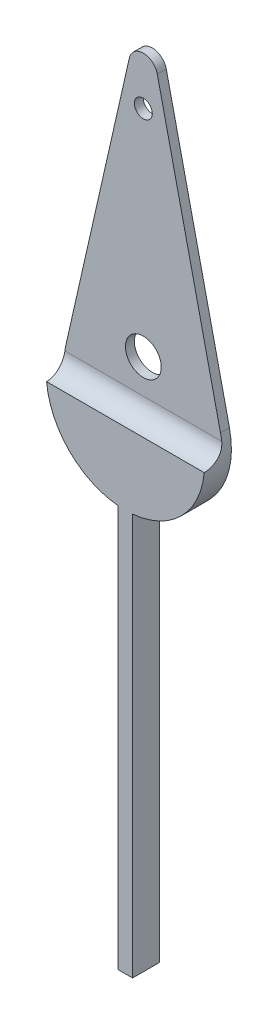
ISO-10303-21;
HEADER;
FILE_DESCRIPTION(('STEP AP214'),'2;1');
FILE_NAME('part.step','',(''),(''),'','','');
FILE_SCHEMA(('AUTOMOTIVE_DESIGN { 1 0 10303 214 1 1 1 1 }'));
ENDSEC;
DATA;
#1=APPLICATION_CONTEXT('core data for automotive mechanical design processes');
#2=APPLICATION_PROTOCOL_DEFINITION('international standard','automotive_design',2000,#1);
#3=PRODUCT_CONTEXT('',#1,'mechanical');
#4=PRODUCT('Part','Part','',(#3));
#5=PRODUCT_RELATED_PRODUCT_CATEGORY('part','',(#4));
#6=PRODUCT_DEFINITION_FORMATION('','',#4);
#7=PRODUCT_DEFINITION_CONTEXT('part definition',#1,'design');
#8=PRODUCT_DEFINITION('design','',#6,#7);
#9=PRODUCT_DEFINITION_SHAPE('','',#8);
#10=(LENGTH_UNIT() NAMED_UNIT(*) SI_UNIT(.MILLI.,.METRE.));
#11=(NAMED_UNIT(*) PLANE_ANGLE_UNIT() SI_UNIT($,.RADIAN.));
#12=(NAMED_UNIT(*) SI_UNIT($,.STERADIAN.) SOLID_ANGLE_UNIT());
#13=UNCERTAINTY_MEASURE_WITH_UNIT(LENGTH_MEASURE(1.E-05),#10,'distance_accuracy_value','');
#14=(GEOMETRIC_REPRESENTATION_CONTEXT(3) GLOBAL_UNCERTAINTY_ASSIGNED_CONTEXT((#13)) GLOBAL_UNIT_ASSIGNED_CONTEXT((#10,
#11,#12)) REPRESENTATION_CONTEXT('',''));
#15=CARTESIAN_POINT('',(0.,0.,0.));
#16=DIRECTION('',(0.,0.,1.));
#17=DIRECTION('',(1.,0.,0.));
#18=AXIS2_PLACEMENT_3D('',#15,#16,#17);
#19=CARTESIAN_POINT('',(6.,-47.5,1.5));
#20=DIRECTION('',(0.,0.,1.));
#21=DIRECTION('',(1.,0.,0.));
#22=AXIS2_PLACEMENT_3D('',#19,#20,#21);
#23=PLANE('',#22);
#24=CARTESIAN_POINT('',(6.,-47.5,1.5));
#25=DIRECTION('',(0.,0.,1.));
#26=DIRECTION('',(1.,0.,0.));
#27=AXIS2_PLACEMENT_3D('',#24,#25,#26);
#28=CIRCLE('',#27,4.41549896987108);
#29=CARTESIAN_POINT('',(6.4,-51.8973436473549,1.5));
#30=VERTEX_POINT('',#29);
#31=CARTESIAN_POINT('',(10.3975844709157,-47.8973436473549,1.5));
#32=VERTEX_POINT('',#31);
#33=EDGE_CURVE('E260',#30,#32,#28,.T.);
#34=ORIENTED_EDGE('',*,*,#33,.T.);
#35=DIRECTION('',(-1.,0.,0.));
#36=VECTOR('',#35,1.);
#37=CARTESIAN_POINT('',(1.58450103012892,-47.8973436473549,1.5));
#38=LINE('',#37,#36);
#39=CARTESIAN_POINT('',(1.60241552908426,-47.8973436473549,1.5));
#40=VERTEX_POINT('',#39);
#41=EDGE_CURVE('E154',#32,#40,#38,.T.);
#42=ORIENTED_EDGE('',*,*,#41,.T.);
#43=CARTESIAN_POINT('',(6.,-47.5,1.5));
#44=DIRECTION('',(0.,0.,1.));
#45=DIRECTION('',(1.,0.,0.));
#46=AXIS2_PLACEMENT_3D('',#43,#44,#45);
#47=CIRCLE('',#46,4.41549896987108);
#48=CARTESIAN_POINT('',(5.6,-51.8973436473549,1.5));
#49=VERTEX_POINT('',#48);
#50=EDGE_CURVE('E159',#40,#49,#47,.T.);
#51=ORIENTED_EDGE('',*,*,#50,.T.);
#52=DIRECTION('',(0.,-1.,0.));
#53=VECTOR('',#52,1.);
#54=CARTESIAN_POINT('',(5.6,-51.8973436473549,1.5));
#55=LINE('',#54,#53);
#56=CARTESIAN_POINT('',(5.6,-74.3160955271791,1.5));
#57=VERTEX_POINT('',#56);
#58=EDGE_CURVE('E287',#49,#57,#55,.T.);
#59=ORIENTED_EDGE('',*,*,#58,.T.);
#60=DIRECTION('',(1.,0.,0.));
#61=VECTOR('',#60,1.);
#62=CARTESIAN_POINT('',(5.6,-74.3160955271791,1.5));
#63=LINE('',#62,#61);
#64=CARTESIAN_POINT('',(6.4,-74.3160955271791,1.5));
#65=VERTEX_POINT('',#64);
#66=EDGE_CURVE('E309',#57,#65,#63,.T.);
#67=ORIENTED_EDGE('',*,*,#66,.T.);
#68=DIRECTION('',(0.,1.,0.));
#69=VECTOR('',#68,1.);
#70=CARTESIAN_POINT('',(6.4,-51.8973436473549,1.5));
#71=LINE('',#70,#69);
#72=EDGE_CURVE('E269',#65,#30,#71,.T.);
#73=ORIENTED_EDGE('',*,*,#72,.T.);
#74=EDGE_LOOP('',(#34,#42,#51,#59,#67,#73));
#75=FACE_BOUND('',#74,.T.);
#76=ADVANCED_FACE('F40',(#75),#23,.T.);
#77=CARTESIAN_POINT('',(6.,-27.5,1.5));
#78=DIRECTION('',(-0.975324777762602,-0.220774948493554,0.));
#79=DIRECTION('',(0.220774948493554,-0.975324777762602,0.));
#80=AXIS2_PLACEMENT_3D('',#77,#78,#79);
#81=PLANE('',#80);
#82=DIRECTION('',(-0.220774948493554,0.975324777762602,0.));
#83=VECTOR('',#82,1.);
#84=CARTESIAN_POINT('',(6.,-27.5,0.));
#85=LINE('',#84,#83);
#86=CARTESIAN_POINT('',(10.3065455515005,-46.5251684423534,0.));
#87=VERTEX_POINT('',#86);
#88=CARTESIAN_POINT('',(6.78025982221008,-30.9469795730305,0.));
#89=VERTEX_POINT('',#88);
#90=EDGE_CURVE('E314',#87,#89,#85,.T.);
#91=ORIENTED_EDGE('',*,*,#90,.T.);
#92=DIRECTION('',(0.,0.,-1.));
#93=VECTOR('',#92,1.);
#94=CARTESIAN_POINT('',(6.78025982221008,-30.9469795730305,1.5));
#95=LINE('',#94,#93);
#96=CARTESIAN_POINT('',(6.78025982221008,-30.9469795730305,0.499999999999996));
#97=VERTEX_POINT('',#96);
#98=EDGE_CURVE('E49',#89,#97,#95,.F.);
#99=ORIENTED_EDGE('',*,*,#98,.T.);
#100=DIRECTION('',(-0.220774948493554,0.975324777762602,0.));
#101=VECTOR('',#100,1.);
#102=CARTESIAN_POINT('',(6.,-27.5,0.499999999999997));
#103=LINE('',#102,#101);
#104=CARTESIAN_POINT('',(10.3065455515005,-46.5251684423534,0.499999999999994));
#105=VERTEX_POINT('',#104);
#106=EDGE_CURVE('E249',#105,#97,#103,.T.);
#107=ORIENTED_EDGE('',*,*,#106,.F.);
#108=DIRECTION('',(0.,0.,-1.));
#109=VECTOR('',#108,1.);
#110=CARTESIAN_POINT('',(10.3065455515005,-46.5251684423534,1.5));
#111=LINE('',#110,#109);
#112=EDGE_CURVE('E258',#105,#87,#111,.T.);
#113=ORIENTED_EDGE('',*,*,#112,.T.);
#114=EDGE_LOOP('',(#91,#99,#107,#113));
#115=FACE_BOUND('',#114,.T.);
#116=ADVANCED_FACE('F223',(#115),#81,.F.);
#117=CARTESIAN_POINT('',(6.,-27.5,1.5));
#118=DIRECTION('',(0.975324777762602,-0.220774948493554,0.));
#119=DIRECTION('',(0.220774948493554,0.975324777762602,0.));
#120=AXIS2_PLACEMENT_3D('',#117,#118,#119);
#121=PLANE('',#120);
#122=DIRECTION('',(-0.220774948493554,-0.975324777762602,0.));
#123=VECTOR('',#122,1.);
#124=CARTESIAN_POINT('',(6.,-27.5,0.499999999999997));
#125=LINE('',#124,#123);
#126=CARTESIAN_POINT('',(5.21974017778992,-30.9469795730305,0.499999999999996));
#127=VERTEX_POINT('',#126);
#128=CARTESIAN_POINT('',(1.69345444849949,-46.5251684423534,0.499999999999994));
#129=VERTEX_POINT('',#128);
#130=EDGE_CURVE('E139',#127,#129,#125,.T.);
#131=ORIENTED_EDGE('',*,*,#130,.F.);
#132=DIRECTION('',(0.,0.,-1.));
#133=VECTOR('',#132,1.);
#134=CARTESIAN_POINT('',(5.21974017778992,-30.9469795730305,1.5));
#135=LINE('',#134,#133);
#136=CARTESIAN_POINT('',(5.21974017778992,-30.9469795730305,0.));
#137=VERTEX_POINT('',#136);
#138=EDGE_CURVE('E196',#127,#137,#135,.T.);
#139=ORIENTED_EDGE('',*,*,#138,.T.);
#140=DIRECTION('',(-0.220774948493554,-0.975324777762602,0.));
#141=VECTOR('',#140,1.);
#142=CARTESIAN_POINT('',(6.,-27.5,0.));
#143=LINE('',#142,#141);
#144=CARTESIAN_POINT('',(1.69345444849949,-46.5251684423534,0.));
#145=VERTEX_POINT('',#144);
#146=EDGE_CURVE('E301',#137,#145,#143,.T.);
#147=ORIENTED_EDGE('',*,*,#146,.T.);
#148=DIRECTION('',(0.,0.,-1.));
#149=VECTOR('',#148,1.);
#150=CARTESIAN_POINT('',(1.69345444849949,-46.5251684423534,1.5));
#151=LINE('',#150,#149);
#152=EDGE_CURVE('E197',#129,#145,#151,.T.);
#153=ORIENTED_EDGE('',*,*,#152,.F.);
#154=EDGE_LOOP('',(#131,#139,#147,#153));
#155=FACE_BOUND('',#154,.T.);
#156=ADVANCED_FACE('F228',(#155),#121,.F.);
#157=CARTESIAN_POINT('',(6.,-47.5,1.5));
#158=DIRECTION('',(0.,0.,-1.));
#159=DIRECTION('',(-1.,0.,0.));
#160=AXIS2_PLACEMENT_3D('',#157,#158,#159);
#161=CYLINDRICAL_SURFACE('',#160,4.41549896987108);
#162=CARTESIAN_POINT('',(1.62582162303033,-46.8973436473549,0.499999999999964));
#163=CARTESIAN_POINT('',(1.62204583926666,-46.9247388762689,0.499999935760209));
#164=CARTESIAN_POINT('',(1.61853212360123,-46.952157922839,0.501126563499402));
#165=CARTESIAN_POINT('',(1.61203755839999,-47.0068730528856,0.505637084601678));
#166=CARTESIAN_POINT('',(1.60905671034121,-47.0341691360211,0.509020984221426));
#167=CARTESIAN_POINT('',(1.60093741353267,-47.1155084002359,0.522546376883282));
#168=CARTESIAN_POINT('',(1.59660706916634,-47.1691133518118,0.536061550523393));
#169=CARTESIAN_POINT('',(1.59000368339094,-47.273486793239,0.571794441656592));
#170=CARTESIAN_POINT('',(1.58773214937031,-47.3242531793172,0.594018518477377));
#171=CARTESIAN_POINT('',(1.58493186487038,-47.4214555904829,0.646561646914125));
#172=CARTESIAN_POINT('',(1.58440287126643,-47.4678922187931,0.676879568613588));
#173=CARTESIAN_POINT('',(1.5846292260879,-47.5551407860134,0.744777370298352));
#174=CARTESIAN_POINT('',(1.58538525859495,-47.5959497165228,0.782361108789357));
#175=CARTESIAN_POINT('',(1.58764653127134,-47.6708026632169,0.863746581774264));
#176=CARTESIAN_POINT('',(1.58915196940392,-47.7048448885798,0.907549957063057));
#177=CARTESIAN_POINT('',(1.59239172874912,-47.7656371265169,1.00079412884773));
#178=CARTESIAN_POINT('',(1.59412887025198,-47.7922822834174,1.05030315941065));
#179=CARTESIAN_POINT('',(1.5973159723718,-47.8369081876826,1.15308018326418));
#180=CARTESIAN_POINT('',(1.59876607195426,-47.8548931337839,1.20634634059337));
#181=CARTESIAN_POINT('',(1.6006943263435,-47.8779369958278,1.29984442372338));
#182=CARTESIAN_POINT('',(1.60133100233884,-47.8852063324992,1.33954306319262));
#183=CARTESIAN_POINT('',(1.60219579466493,-47.8949115034814,1.41948897353512));
#184=CARTESIAN_POINT('',(1.60242433451028,-47.8973523485038,1.45973563197671));
#185=CARTESIAN_POINT('',(1.60241552908426,-47.8973436473549,1.5));
#186=B_SPLINE_CURVE_WITH_KNOTS('',3,(#162,#163,#164,#165,#166,#167,#168,#169,#170,#171,#172,
#173,#174,#175,#176,#177,#178,#179,#180,#181,#182,#183,#184,#185),.UNSPECIFIED.,.F.,.F.,(4,2,2,
2,2,2,2,2,2,2,2,4),(0.,0.0829136028333963,0.165827435486195,0.331324009229433,0.496941656081441,
0.662536194466835,0.828218914457806,0.993945424497027,1.16191341182595,1.32979988090902,
1.45061020657461,1.57129509681288),.UNSPECIFIED.);
#187=CARTESIAN_POINT('',(1.62582162303033,-46.8973436473549,0.499999999999994));
#188=VERTEX_POINT('',#187);
#189=EDGE_CURVE('E145',#188,#40,#186,.T.);
#190=ORIENTED_EDGE('',*,*,#189,.F.);
#191=CARTESIAN_POINT('',(6.,-47.5,0.499999999999994));
#192=DIRECTION('',(0.,0.,1.));
#193=DIRECTION('',(0.,-1.,0.));
#194=AXIS2_PLACEMENT_3D('',#191,#192,#193);
#195=CIRCLE('',#194,4.41549896987108);
#196=EDGE_CURVE('E133',#129,#188,#195,.T.);
#197=ORIENTED_EDGE('',*,*,#196,.F.);
#198=ORIENTED_EDGE('',*,*,#152,.T.);
#199=CARTESIAN_POINT('',(6.,-47.5,0.));
#200=DIRECTION('',(0.,0.,1.));
#201=DIRECTION('',(1.,0.,0.));
#202=AXIS2_PLACEMENT_3D('',#199,#200,#201);
#203=CIRCLE('',#202,4.41549896987108);
#204=CARTESIAN_POINT('',(5.6,-51.8973436473549,0.));
#205=VERTEX_POINT('',#204);
#206=EDGE_CURVE('E291',#145,#205,#203,.T.);
#207=ORIENTED_EDGE('',*,*,#206,.T.);
#208=DIRECTION('',(0.,0.,-1.));
#209=VECTOR('',#208,1.);
#210=CARTESIAN_POINT('',(5.6,-51.8973436473549,1.5));
#211=LINE('',#210,#209);
#212=EDGE_CURVE('E257',#49,#205,#211,.T.);
#213=ORIENTED_EDGE('',*,*,#212,.F.);
#214=ORIENTED_EDGE('',*,*,#50,.F.);
#215=EDGE_LOOP('',(#190,#197,#198,#207,#213,#214));
#216=FACE_BOUND('',#215,.T.);
#217=ADVANCED_FACE('F157',(#216),#161,.T.);
#218=CARTESIAN_POINT('',(6.,-47.5,1.5));
#219=DIRECTION('',(0.,0.,-1.));
#220=DIRECTION('',(-1.,0.,0.));
#221=AXIS2_PLACEMENT_3D('',#218,#219,#220);
#222=CYLINDRICAL_SURFACE('',#221,4.41549896987108);
#223=CARTESIAN_POINT('',(10.3975844709157,-47.8973436473549,1.5));
#224=CARTESIAN_POINT('',(10.3975829180978,-47.8973435369531,1.47190037807518));
#225=CARTESIAN_POINT('',(10.3976917261108,-47.8961585248377,1.44381431099081));
#226=CARTESIAN_POINT('',(10.3981156011552,-47.8914315175774,1.38784485000167));
#227=CARTESIAN_POINT('',(10.3984306532947,-47.8878896926055,1.35996144161093));
#228=CARTESIAN_POINT('',(10.3996619954915,-47.8737653429627,1.27697449464489));
#229=CARTESIAN_POINT('',(10.4008645734437,-47.859683833374,1.22242939438074));
#230=CARTESIAN_POINT('',(10.4037382606811,-47.8225870379193,1.11648948703224));
#231=CARTESIAN_POINT('',(10.4054095477684,-47.7995683605139,1.06509588448416));
#232=CARTESIAN_POINT('',(10.4087666512496,-47.7452458690494,0.966887735414993));
#233=CARTESIAN_POINT('',(10.4104524667453,-47.7139425636675,0.920072907998244));
#234=CARTESIAN_POINT('',(10.4132947288033,-47.6438423310132,0.832238864481918));
#235=CARTESIAN_POINT('',(10.4144499336699,-47.605028125664,0.791233396390601));
#236=CARTESIAN_POINT('',(10.4156480350228,-47.5210451668558,0.716315155575321));
#237=CARTESIAN_POINT('',(10.4156908791132,-47.4758761141623,0.682402717032316));
#238=CARTESIAN_POINT('',(10.4141443140146,-47.3808227873252,0.622860880459064));
#239=CARTESIAN_POINT('',(10.4125658191741,-47.3309720681659,0.597177603510841));
#240=CARTESIAN_POINT('',(10.4074014714243,-47.2277778617109,0.554523639876488));
#241=CARTESIAN_POINT('',(10.4038166505172,-47.1744361825209,0.537548482555747));
#242=CARTESIAN_POINT('',(10.3959691130568,-47.0835361373131,0.516766410843859));
#243=CARTESIAN_POINT('',(10.3923039505298,-47.0464735698626,0.510473822389614));
#244=CARTESIAN_POINT('',(10.3839824378447,-46.9720368459461,0.502089837553739));
#245=CARTESIAN_POINT('',(10.3793274204467,-46.9346631727331,0.499992831285645));
#246=CARTESIAN_POINT('',(10.3741783769697,-46.8973436473549,0.499999999999964));
#247=B_SPLINE_CURVE_WITH_KNOTS('',3,(#223,#224,#225,#226,#227,#228,#229,#230,#231,#232,#233,
#234,#235,#236,#237,#238,#239,#240,#241,#242,#243,#244,#245,#246),.UNSPECIFIED.,.F.,.F.,(4,2,2,
2,2,2,2,2,2,2,2,4),(0.,0.084246809003493,0.168487535652777,0.336658490566312,0.504893326655594,
0.673117835503424,0.841734029983362,1.01035816685727,1.17785457082816,1.34526489806432,
1.45834531696421,1.57127443543271),.UNSPECIFIED.);
#248=CARTESIAN_POINT('',(10.3741783769697,-46.8973436473549,0.499999999999964));
#249=VERTEX_POINT('',#248);
#250=EDGE_CURVE('E151',#32,#249,#247,.T.);
#251=ORIENTED_EDGE('',*,*,#250,.F.);
#252=ORIENTED_EDGE('',*,*,#33,.F.);
#253=DIRECTION('',(0.,0.,-1.));
#254=VECTOR('',#253,1.);
#255=CARTESIAN_POINT('',(6.4,-51.8973436473549,1.5));
#256=LINE('',#255,#254);
#257=CARTESIAN_POINT('',(6.4,-51.8973436473549,0.));
#258=VERTEX_POINT('',#257);
#259=EDGE_CURVE('E259',#30,#258,#256,.T.);
#260=ORIENTED_EDGE('',*,*,#259,.T.);
#261=CARTESIAN_POINT('',(6.,-47.5,0.));
#262=DIRECTION('',(0.,0.,1.));
#263=DIRECTION('',(1.,0.,0.));
#264=AXIS2_PLACEMENT_3D('',#261,#262,#263);
#265=CIRCLE('',#264,4.41549896987108);
#266=EDGE_CURVE('E272',#258,#87,#265,.T.);
#267=ORIENTED_EDGE('',*,*,#266,.T.);
#268=ORIENTED_EDGE('',*,*,#112,.F.);
#269=CARTESIAN_POINT('',(6.,-47.5,0.499999999999994));
#270=DIRECTION('',(0.,0.,1.));
#271=DIRECTION('',(0.,-1.,0.));
#272=AXIS2_PLACEMENT_3D('',#269,#270,#271);
#273=CIRCLE('',#272,4.41549896987108);
#274=EDGE_CURVE('E244',#249,#105,#273,.T.);
#275=ORIENTED_EDGE('',*,*,#274,.F.);
#276=EDGE_LOOP('',(#251,#252,#260,#267,#268,#275));
#277=FACE_BOUND('',#276,.T.);
#278=ADVANCED_FACE('F201',(#277),#222,.T.);
#279=CARTESIAN_POINT('',(6.,-33.,1.5));
#280=DIRECTION('',(0.,0.,-1.));
#281=DIRECTION('',(-1.,0.,0.));
#282=AXIS2_PLACEMENT_3D('',#279,#280,#281);
#283=CYLINDRICAL_SURFACE('',#282,0.500000000000001);
#284=CARTESIAN_POINT('',(6.,-33.,0.));
#285=DIRECTION('',(0.,0.,1.));
#286=DIRECTION('',(1.,0.,0.));
#287=AXIS2_PLACEMENT_3D('',#284,#285,#286);
#288=CIRCLE('',#287,0.500000000000001);
#289=CARTESIAN_POINT('',(6.5,-33.,0.));
#290=VERTEX_POINT('',#289);
#291=EDGE_CURVE('E166',#290,#290,#288,.T.);
#292=ORIENTED_EDGE('',*,*,#291,.F.);
#293=EDGE_LOOP('',(#292));
#294=FACE_BOUND('',#293,.T.);
#295=CARTESIAN_POINT('',(6.,-33.,0.499999999999996));
#296=DIRECTION('',(0.,0.,1.));
#297=DIRECTION('',(0.,-1.,0.));
#298=AXIS2_PLACEMENT_3D('',#295,#296,#297);
#299=CIRCLE('',#298,0.500000000000001);
#300=CARTESIAN_POINT('',(6.,-33.5,0.499999999999996));
#301=VERTEX_POINT('',#300);
#302=EDGE_CURVE('E241',#301,#301,#299,.T.);
#303=ORIENTED_EDGE('',*,*,#302,.T.);
#304=EDGE_LOOP('',(#303));
#305=FACE_BOUND('',#304,.T.);
#306=ADVANCED_FACE('F206',(#294,#305),#283,.F.);
#307=CARTESIAN_POINT('',(6.,-45.,1.5));
#308=DIRECTION('',(0.,0.,-1.));
#309=DIRECTION('',(-1.,0.,0.));
#310=AXIS2_PLACEMENT_3D('',#307,#308,#309);
#311=CYLINDRICAL_SURFACE('',#310,1.);
#312=CARTESIAN_POINT('',(6.,-45.,0.));
#313=DIRECTION('',(0.,0.,1.));
#314=DIRECTION('',(1.,0.,0.));
#315=AXIS2_PLACEMENT_3D('',#312,#313,#314);
#316=CIRCLE('',#315,1.);
#317=CARTESIAN_POINT('',(7.,-45.,0.));
#318=VERTEX_POINT('',#317);
#319=EDGE_CURVE('E161',#318,#318,#316,.T.);
#320=ORIENTED_EDGE('',*,*,#319,.F.);
#321=EDGE_LOOP('',(#320));
#322=FACE_BOUND('',#321,.T.);
#323=CARTESIAN_POINT('',(6.,-45.,0.499999999999994));
#324=DIRECTION('',(0.,0.,1.));
#325=DIRECTION('',(0.,-1.,0.));
#326=AXIS2_PLACEMENT_3D('',#323,#324,#325);
#327=CIRCLE('',#326,1.);
#328=CARTESIAN_POINT('',(6.,-46.,0.499999999999994));
#329=VERTEX_POINT('',#328);
#330=EDGE_CURVE('E198',#329,#329,#327,.T.);
#331=ORIENTED_EDGE('',*,*,#330,.T.);
#332=EDGE_LOOP('',(#331));
#333=FACE_BOUND('',#332,.T.);
#334=ADVANCED_FACE('F184',(#322,#333),#311,.F.);
#335=CARTESIAN_POINT('',(6.,-47.5,0.));
#336=DIRECTION('',(0.,0.,1.));
#337=DIRECTION('',(1.,0.,0.));
#338=AXIS2_PLACEMENT_3D('',#335,#336,#337);
#339=PLANE('',#338);
#340=ORIENTED_EDGE('',*,*,#146,.F.);
#341=CARTESIAN_POINT('',(6.,-31.1235995318253,0.));
#342=DIRECTION('',(0.,0.,1.));
#343=DIRECTION('',(1.,0.,0.));
#344=AXIS2_PLACEMENT_3D('',#341,#342,#343);
#345=CIRCLE('',#344,0.8);
#346=EDGE_CURVE('E68',#137,#89,#345,.F.);
#347=ORIENTED_EDGE('',*,*,#346,.T.);
#348=ORIENTED_EDGE('',*,*,#90,.F.);
#349=ORIENTED_EDGE('',*,*,#266,.F.);
#350=DIRECTION('',(0.,1.,0.));
#351=VECTOR('',#350,1.);
#352=CARTESIAN_POINT('',(6.4,-51.8973436473549,0.));
#353=LINE('',#352,#351);
#354=CARTESIAN_POINT('',(6.4,-74.3160955271791,0.));
#355=VERTEX_POINT('',#354);
#356=EDGE_CURVE('E298',#355,#258,#353,.T.);
#357=ORIENTED_EDGE('',*,*,#356,.F.);
#358=DIRECTION('',(1.,0.,0.));
#359=VECTOR('',#358,1.);
#360=CARTESIAN_POINT('',(5.6,-74.3160955271791,0.));
#361=LINE('',#360,#359);
#362=CARTESIAN_POINT('',(5.6,-74.3160955271791,0.));
#363=VERTEX_POINT('',#362);
#364=EDGE_CURVE('E293',#363,#355,#361,.T.);
#365=ORIENTED_EDGE('',*,*,#364,.F.);
#366=DIRECTION('',(0.,-1.,0.));
#367=VECTOR('',#366,1.);
#368=CARTESIAN_POINT('',(5.6,-51.8973436473549,0.));
#369=LINE('',#368,#367);
#370=EDGE_CURVE('E286',#205,#363,#369,.T.);
#371=ORIENTED_EDGE('',*,*,#370,.F.);
#372=ORIENTED_EDGE('',*,*,#206,.F.);
#373=EDGE_LOOP('',(#340,#347,#348,#349,#357,#365,#371,#372));
#374=FACE_BOUND('',#373,.T.);
#375=ORIENTED_EDGE('',*,*,#291,.T.);
#376=EDGE_LOOP('',(#375));
#377=FACE_BOUND('',#376,.T.);
#378=ORIENTED_EDGE('',*,*,#319,.T.);
#379=EDGE_LOOP('',(#378));
#380=FACE_BOUND('',#379,.T.);
#381=ADVANCED_FACE('F208',(#374,#377,#380),#339,.F.);
#382=CARTESIAN_POINT('',(5.6,-51.8973436473549,1.5));
#383=DIRECTION('',(1.,0.,0.));
#384=DIRECTION('',(0.,1.,0.));
#385=AXIS2_PLACEMENT_3D('',#382,#383,#384);
#386=PLANE('',#385);
#387=ORIENTED_EDGE('',*,*,#370,.T.);
#388=DIRECTION('',(0.,0.,-1.));
#389=VECTOR('',#388,1.);
#390=CARTESIAN_POINT('',(5.6,-74.3160955271791,1.5));
#391=LINE('',#390,#389);
#392=EDGE_CURVE('E277',#57,#363,#391,.T.);
#393=ORIENTED_EDGE('',*,*,#392,.F.);
#394=ORIENTED_EDGE('',*,*,#58,.F.);
#395=ORIENTED_EDGE('',*,*,#212,.T.);
#396=EDGE_LOOP('',(#387,#393,#394,#395));
#397=FACE_BOUND('',#396,.T.);
#398=ADVANCED_FACE('F215',(#397),#386,.F.);
#399=CARTESIAN_POINT('',(5.6,-74.3160955271791,1.5));
#400=DIRECTION('',(0.,1.,0.));
#401=DIRECTION('',(0.,0.,1.));
#402=AXIS2_PLACEMENT_3D('',#399,#400,#401);
#403=PLANE('',#402);
#404=ORIENTED_EDGE('',*,*,#364,.T.);
#405=DIRECTION('',(0.,0.,-1.));
#406=VECTOR('',#405,1.);
#407=CARTESIAN_POINT('',(6.4,-74.3160955271791,1.5));
#408=LINE('',#407,#406);
#409=EDGE_CURVE('E266',#65,#355,#408,.T.);
#410=ORIENTED_EDGE('',*,*,#409,.F.);
#411=ORIENTED_EDGE('',*,*,#66,.F.);
#412=ORIENTED_EDGE('',*,*,#392,.T.);
#413=EDGE_LOOP('',(#404,#410,#411,#412));
#414=FACE_BOUND('',#413,.T.);
#415=ADVANCED_FACE('F212',(#414),#403,.F.);
#416=CARTESIAN_POINT('',(6.4,-51.8973436473549,1.5));
#417=DIRECTION('',(-1.,0.,0.));
#418=DIRECTION('',(0.,-1.,0.));
#419=AXIS2_PLACEMENT_3D('',#416,#417,#418);
#420=PLANE('',#419);
#421=ORIENTED_EDGE('',*,*,#356,.T.);
#422=ORIENTED_EDGE('',*,*,#259,.F.);
#423=ORIENTED_EDGE('',*,*,#72,.F.);
#424=ORIENTED_EDGE('',*,*,#409,.T.);
#425=EDGE_LOOP('',(#421,#422,#423,#424));
#426=FACE_BOUND('',#425,.T.);
#427=ADVANCED_FACE('F183',(#426),#420,.F.);
#428=CARTESIAN_POINT('',(1.58450103012892,-46.8973436473549,1.5));
#429=DIRECTION('',(-1.,0.,0.));
#430=DIRECTION('',(0.,0.,1.));
#431=AXIS2_PLACEMENT_3D('',#428,#429,#430);
#432=CYLINDRICAL_SURFACE('',#431,1.00000000000003);
#433=ORIENTED_EDGE('',*,*,#189,.T.);
#434=ORIENTED_EDGE('',*,*,#41,.F.);
#435=ORIENTED_EDGE('',*,*,#250,.T.);
#436=DIRECTION('',(-1.,0.,0.));
#437=VECTOR('',#436,1.);
#438=CARTESIAN_POINT('',(1.58450103012892,-46.8973436473549,0.499999999999994));
#439=LINE('',#438,#437);
#440=EDGE_CURVE('E136',#249,#188,#439,.T.);
#441=ORIENTED_EDGE('',*,*,#440,.T.);
#442=EDGE_LOOP('',(#433,#434,#435,#441));
#443=FACE_BOUND('',#442,.T.);
#444=ADVANCED_FACE('F148',(#443),#432,.F.);
#445=CARTESIAN_POINT('',(1.58450103012892,-14.744083324379,0.499999999999999));
#446=DIRECTION('',(0.,0.,1.));
#447=DIRECTION('',(0.,-1.,0.));
#448=AXIS2_PLACEMENT_3D('',#445,#446,#447);
#449=PLANE('',#448);
#450=ORIENTED_EDGE('',*,*,#330,.F.);
#451=EDGE_LOOP('',(#450));
#452=FACE_BOUND('',#451,.T.);
#453=ORIENTED_EDGE('',*,*,#302,.F.);
#454=EDGE_LOOP('',(#453));
#455=FACE_BOUND('',#454,.T.);
#456=ORIENTED_EDGE('',*,*,#106,.T.);
#457=CARTESIAN_POINT('',(6.,-31.1235995318253,0.499999999999996));
#458=DIRECTION('',(0.,0.,1.));
#459=DIRECTION('',(0.,-1.,0.));
#460=AXIS2_PLACEMENT_3D('',#457,#458,#459);
#461=CIRCLE('',#460,0.8);
#462=EDGE_CURVE('E11',#97,#127,#461,.T.);
#463=ORIENTED_EDGE('',*,*,#462,.T.);
#464=ORIENTED_EDGE('',*,*,#130,.T.);
#465=ORIENTED_EDGE('',*,*,#196,.T.);
#466=ORIENTED_EDGE('',*,*,#440,.F.);
#467=ORIENTED_EDGE('',*,*,#274,.T.);
#468=EDGE_LOOP('',(#456,#463,#464,#465,#466,#467));
#469=FACE_BOUND('',#468,.T.);
#470=ADVANCED_FACE('F135',(#452,#455,#469),#449,.T.);
#471=CARTESIAN_POINT('',(6.,-31.1235995318253,1.5));
#472=DIRECTION('',(0.,0.,-1.));
#473=DIRECTION('',(-1.,0.,0.));
#474=AXIS2_PLACEMENT_3D('',#471,#472,#473);
#475=CYLINDRICAL_SURFACE('',#474,0.8);
#476=ORIENTED_EDGE('',*,*,#462,.F.);
#477=ORIENTED_EDGE('',*,*,#98,.F.);
#478=ORIENTED_EDGE('',*,*,#346,.F.);
#479=ORIENTED_EDGE('',*,*,#138,.F.);
#480=EDGE_LOOP('',(#476,#477,#478,#479));
#481=FACE_BOUND('',#480,.T.);
#482=ADVANCED_FACE('F42',(#481),#475,.T.);
#483=CLOSED_SHELL('',(#76,#116,#156,#217,#278,#306,#334,#381,#398,#415,#427,#444,#470,#482));
#484=MANIFOLD_SOLID_BREP('B2',#483);
#485=ADVANCED_BREP_SHAPE_REPRESENTATION('',(#18,#484),#14);
#486=SHAPE_DEFINITION_REPRESENTATION(#9,#485);
ENDSEC;
END-ISO-10303-21;
